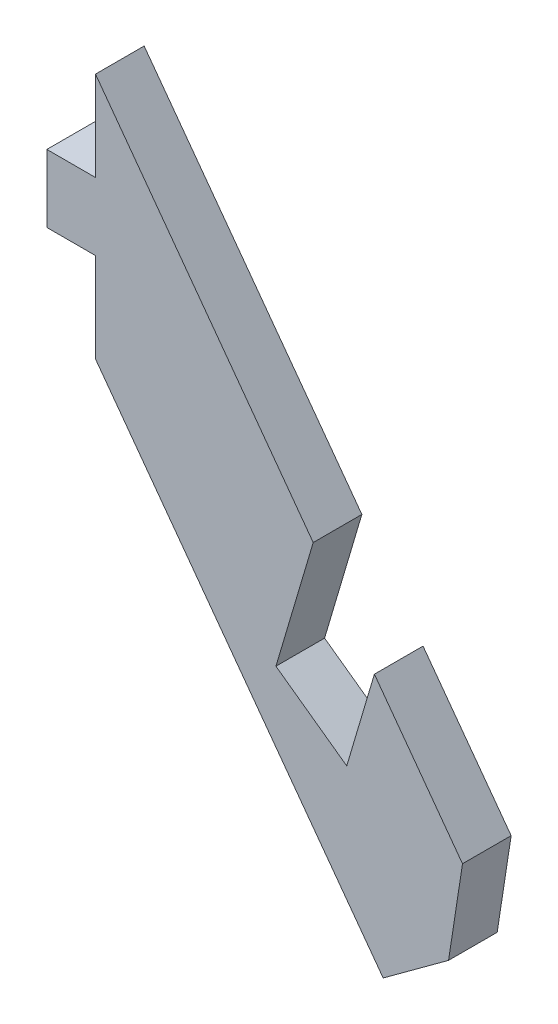
ISO-10303-21;
HEADER;
FILE_DESCRIPTION(('STEP AP214'),'2;1');
FILE_NAME('part.step','',(''),(''),'','','');
FILE_SCHEMA(('AUTOMOTIVE_DESIGN { 1 0 10303 214 1 1 1 1 }'));
ENDSEC;
DATA;
#1=APPLICATION_CONTEXT('core data for automotive mechanical design processes');
#2=APPLICATION_PROTOCOL_DEFINITION('international standard','automotive_design',2000,#1);
#3=PRODUCT_CONTEXT('',#1,'mechanical');
#4=PRODUCT('Part','Part','',(#3));
#5=PRODUCT_RELATED_PRODUCT_CATEGORY('part','',(#4));
#6=PRODUCT_DEFINITION_FORMATION('','',#4);
#7=PRODUCT_DEFINITION_CONTEXT('part definition',#1,'design');
#8=PRODUCT_DEFINITION('design','',#6,#7);
#9=PRODUCT_DEFINITION_SHAPE('','',#8);
#10=(LENGTH_UNIT() NAMED_UNIT(*) SI_UNIT(.MILLI.,.METRE.));
#11=(NAMED_UNIT(*) PLANE_ANGLE_UNIT() SI_UNIT($,.RADIAN.));
#12=(NAMED_UNIT(*) SI_UNIT($,.STERADIAN.) SOLID_ANGLE_UNIT());
#13=UNCERTAINTY_MEASURE_WITH_UNIT(LENGTH_MEASURE(1.E-05),#10,'distance_accuracy_value','');
#14=(GEOMETRIC_REPRESENTATION_CONTEXT(3) GLOBAL_UNCERTAINTY_ASSIGNED_CONTEXT((#13)) GLOBAL_UNIT_ASSIGNED_CONTEXT((#10,
#11,#12)) REPRESENTATION_CONTEXT('',''));
#15=CARTESIAN_POINT('',(0.,0.,0.));
#16=DIRECTION('',(0.,0.,1.));
#17=DIRECTION('',(1.,0.,0.));
#18=AXIS2_PLACEMENT_3D('',#15,#16,#17);
#19=CARTESIAN_POINT('',(0.,14.5,-3.));
#20=DIRECTION('',(0.806359702266459,0.591425422653396,0.));
#21=DIRECTION('',(-0.591425422653396,0.806359702266459,0.));
#22=AXIS2_PLACEMENT_3D('',#19,#20,#21);
#23=PLANE('',#22);
#24=DIRECTION('',(0.,0.,-1.));
#25=VECTOR('',#24,1.);
#26=CARTESIAN_POINT('',(13.4271237133215,-3.80677388062509,12.4751845407217));
#27=LINE('',#26,#25);
#28=CARTESIAN_POINT('',(13.4271237133215,-3.80677388062509,0.));
#29=VERTEX_POINT('',#28);
#30=CARTESIAN_POINT('',(13.4271237133215,-3.80677388062509,-3.));
#31=VERTEX_POINT('',#30);
#32=EDGE_CURVE('E136',#29,#31,#27,.T.);
#33=ORIENTED_EDGE('',*,*,#32,.T.);
#34=DIRECTION('',(-0.591425422653396,0.806359702266459,0.));
#35=VECTOR('',#34,1.);
#36=CARTESIAN_POINT('',(0.,14.5,-3.));
#37=LINE('',#36,#35);
#38=CARTESIAN_POINT('',(0.,14.5,-3.));
#39=VERTEX_POINT('',#38);
#40=EDGE_CURVE('E150',#31,#39,#37,.T.);
#41=ORIENTED_EDGE('',*,*,#40,.T.);
#42=DIRECTION('',(0.,0.,1.));
#43=VECTOR('',#42,1.);
#44=CARTESIAN_POINT('',(0.,14.5,-3.));
#45=LINE('',#44,#43);
#46=CARTESIAN_POINT('',(0.,14.5,0.));
#47=VERTEX_POINT('',#46);
#48=EDGE_CURVE('E185',#39,#47,#45,.T.);
#49=ORIENTED_EDGE('',*,*,#48,.T.);
#50=DIRECTION('',(-0.591425422653396,0.806359702266459,0.));
#51=VECTOR('',#50,1.);
#52=CARTESIAN_POINT('',(0.,14.5,0.));
#53=LINE('',#52,#51);
#54=EDGE_CURVE('E152',#29,#47,#53,.T.);
#55=ORIENTED_EDGE('',*,*,#54,.F.);
#56=EDGE_LOOP('',(#33,#41,#49,#55));
#57=FACE_BOUND('',#56,.T.);
#58=ADVANCED_FACE('F39',(#57),#23,.T.);
#59=CARTESIAN_POINT('',(0.,14.5,-3.));
#60=DIRECTION('',(-1.,0.,0.));
#61=DIRECTION('',(0.,-1.,0.));
#62=AXIS2_PLACEMENT_3D('',#59,#60,#61);
#63=PLANE('',#62);
#64=DIRECTION('',(0.,-1.,0.));
#65=VECTOR('',#64,1.);
#66=CARTESIAN_POINT('',(0.,14.5,-3.));
#67=LINE('',#66,#65);
#68=CARTESIAN_POINT('',(0.,8.97626383879308,-3.));
#69=VERTEX_POINT('',#68);
#70=EDGE_CURVE('E160',#39,#69,#67,.T.);
#71=ORIENTED_EDGE('',*,*,#70,.T.);
#72=DIRECTION('',(0.,0.,1.));
#73=VECTOR('',#72,1.);
#74=CARTESIAN_POINT('',(0.,8.97626383879308,-8.13701275061684));
#75=LINE('',#74,#73);
#76=CARTESIAN_POINT('',(0.,8.97626383879308,0.));
#77=VERTEX_POINT('',#76);
#78=EDGE_CURVE('E173',#69,#77,#75,.T.);
#79=ORIENTED_EDGE('',*,*,#78,.T.);
#80=DIRECTION('',(0.,-1.,0.));
#81=VECTOR('',#80,1.);
#82=CARTESIAN_POINT('',(0.,14.5,0.));
#83=LINE('',#82,#81);
#84=EDGE_CURVE('E190',#47,#77,#83,.T.);
#85=ORIENTED_EDGE('',*,*,#84,.F.);
#86=ORIENTED_EDGE('',*,*,#48,.F.);
#87=EDGE_LOOP('',(#71,#79,#85,#86));
#88=FACE_BOUND('',#87,.T.);
#89=ADVANCED_FACE('F252',(#88),#63,.T.);
#90=CARTESIAN_POINT('',(22.6342983093864,-16.3599957774612,0.));
#91=VERTEX_POINT('',#90);
#92=CARTESIAN_POINT('',(17.2005647618662,-8.95154900167658,0.));
#93=VERTEX_POINT('',#92);
#94=EDGE_CURVE('E186',#91,#93,#53,.T.);
#95=ORIENTED_EDGE('',*,*,#94,.F.);
#96=DIRECTION('',(0.,0.,-1.));
#97=VECTOR('',#96,1.);
#98=CARTESIAN_POINT('',(22.6342983093864,-16.3599957774612,-3.));
#99=LINE('',#98,#97);
#100=CARTESIAN_POINT('',(22.6342983093864,-16.3599957774612,-3.));
#101=VERTEX_POINT('',#100);
#102=EDGE_CURVE('E49',#91,#101,#99,.T.);
#103=ORIENTED_EDGE('',*,*,#102,.T.);
#104=CARTESIAN_POINT('',(17.2005647618662,-8.95154900167658,-3.));
#105=VERTEX_POINT('',#104);
#106=EDGE_CURVE('E162',#101,#105,#37,.T.);
#107=ORIENTED_EDGE('',*,*,#106,.T.);
#108=DIRECTION('',(0.,0.,-1.));
#109=VECTOR('',#108,1.);
#110=CARTESIAN_POINT('',(17.2005647618662,-8.95154900167658,12.4751845407217));
#111=LINE('',#110,#109);
#112=EDGE_CURVE('E154',#93,#105,#111,.T.);
#113=ORIENTED_EDGE('',*,*,#112,.F.);
#114=EDGE_LOOP('',(#95,#103,#107,#113));
#115=FACE_BOUND('',#114,.T.);
#116=ADVANCED_FACE('F253',(#115),#23,.T.);
#117=CARTESIAN_POINT('',(25.,-19.5854345865271,-3.));
#118=DIRECTION('',(0.591425422653395,-0.806359702266459,0.));
#119=DIRECTION('',(0.806359702266459,0.591425422653395,0.));
#120=AXIS2_PLACEMENT_3D('',#117,#118,#119);
#121=PLANE('',#120);
#122=DIRECTION('',(0.806359702266459,0.591425422653395,0.));
#123=VECTOR('',#122,1.);
#124=CARTESIAN_POINT('',(25.,-19.5854345865271,-3.));
#125=LINE('',#124,#123);
#126=CARTESIAN_POINT('',(17.7427626796019,-24.9082633904076,-3.));
#127=VERTEX_POINT('',#126);
#128=CARTESIAN_POINT('',(21.7745611909342,-21.9511362771407,-3.));
#129=VERTEX_POINT('',#128);
#130=EDGE_CURVE('E181',#127,#129,#125,.T.);
#131=ORIENTED_EDGE('',*,*,#130,.T.);
#132=DIRECTION('',(0.,0.,1.));
#133=VECTOR('',#132,1.);
#134=CARTESIAN_POINT('',(21.7745611909342,-21.9511362771407,-3.));
#135=LINE('',#134,#133);
#136=CARTESIAN_POINT('',(21.7745611909342,-21.9511362771407,0.));
#137=VERTEX_POINT('',#136);
#138=EDGE_CURVE('E200',#129,#137,#135,.T.);
#139=ORIENTED_EDGE('',*,*,#138,.T.);
#140=DIRECTION('',(0.806359702266459,0.591425422653395,0.));
#141=VECTOR('',#140,1.);
#142=CARTESIAN_POINT('',(25.,-19.5854345865271,0.));
#143=LINE('',#142,#141);
#144=CARTESIAN_POINT('',(17.7427626796019,-24.9082633904076,0.));
#145=VERTEX_POINT('',#144);
#146=EDGE_CURVE('E163',#145,#137,#143,.T.);
#147=ORIENTED_EDGE('',*,*,#146,.F.);
#148=DIRECTION('',(0.,0.,1.));
#149=VECTOR('',#148,1.);
#150=CARTESIAN_POINT('',(17.7427626796019,-24.9082633904076,-3.));
#151=LINE('',#150,#149);
#152=EDGE_CURVE('E197',#127,#145,#151,.T.);
#153=ORIENTED_EDGE('',*,*,#152,.F.);
#154=EDGE_LOOP('',(#131,#139,#147,#153));
#155=FACE_BOUND('',#154,.T.);
#156=ADVANCED_FACE('F240',(#155),#121,.T.);
#157=CARTESIAN_POINT('',(17.7427626796019,-24.9082633904076,-3.));
#158=DIRECTION('',(-0.806359702266459,-0.591425422653396,0.));
#159=DIRECTION('',(0.591425422653396,-0.806359702266459,0.));
#160=AXIS2_PLACEMENT_3D('',#157,#158,#159);
#161=PLANE('',#160);
#162=DIRECTION('',(0.591425422653396,-0.806359702266459,0.));
#163=VECTOR('',#162,1.);
#164=CARTESIAN_POINT('',(17.7427626796019,-24.9082633904076,0.));
#165=LINE('',#164,#163);
#166=CARTESIAN_POINT('',(0.,-0.717472322413876,0.));
#167=VERTEX_POINT('',#166);
#168=EDGE_CURVE('E169',#167,#145,#165,.T.);
#169=ORIENTED_EDGE('',*,*,#168,.F.);
#170=DIRECTION('',(0.,0.,1.));
#171=VECTOR('',#170,1.);
#172=CARTESIAN_POINT('',(0.,-0.717472322413876,-3.));
#173=LINE('',#172,#171);
#174=CARTESIAN_POINT('',(0.,-0.717472322413876,-3.));
#175=VERTEX_POINT('',#174);
#176=EDGE_CURVE('E201',#175,#167,#173,.T.);
#177=ORIENTED_EDGE('',*,*,#176,.F.);
#178=DIRECTION('',(0.591425422653396,-0.806359702266459,0.));
#179=VECTOR('',#178,1.);
#180=CARTESIAN_POINT('',(17.7427626796019,-24.9082633904076,-3.));
#181=LINE('',#180,#179);
#182=EDGE_CURVE('E177',#175,#127,#181,.T.);
#183=ORIENTED_EDGE('',*,*,#182,.T.);
#184=ORIENTED_EDGE('',*,*,#152,.T.);
#185=EDGE_LOOP('',(#169,#177,#183,#184));
#186=FACE_BOUND('',#185,.T.);
#187=ADVANCED_FACE('F235',(#186),#161,.T.);
#188=DIRECTION('',(0.,0.,1.));
#189=VECTOR('',#188,1.);
#190=CARTESIAN_POINT('',(0.,4.80626383879308,-8.13701275061684));
#191=LINE('',#190,#189);
#192=CARTESIAN_POINT('',(0.,4.80626383879308,-3.));
#193=VERTEX_POINT('',#192);
#194=CARTESIAN_POINT('',(0.,4.80626383879308,0.));
#195=VERTEX_POINT('',#194);
#196=EDGE_CURVE('E232',#193,#195,#191,.T.);
#197=ORIENTED_EDGE('',*,*,#196,.F.);
#198=EDGE_CURVE('E168',#193,#175,#67,.T.);
#199=ORIENTED_EDGE('',*,*,#198,.T.);
#200=ORIENTED_EDGE('',*,*,#176,.T.);
#201=EDGE_CURVE('E189',#195,#167,#83,.T.);
#202=ORIENTED_EDGE('',*,*,#201,.F.);
#203=EDGE_LOOP('',(#197,#199,#200,#202));
#204=FACE_BOUND('',#203,.T.);
#205=ADVANCED_FACE('F229',(#204),#63,.T.);
#206=CARTESIAN_POINT('',(0.,0.,-3.));
#207=DIRECTION('',(0.,0.,-1.));
#208=DIRECTION('',(-1.,0.,0.));
#209=AXIS2_PLACEMENT_3D('',#206,#207,#208);
#210=PLANE('',#209);
#211=ORIENTED_EDGE('',*,*,#106,.F.);
#212=DIRECTION('',(0.151981486623839,0.988383340472515,0.));
#213=VECTOR('',#212,1.);
#214=CARTESIAN_POINT('',(24.5690154865547,-3.77792233602964,-3.));
#215=LINE('',#214,#213);
#216=EDGE_CURVE('E11',#101,#129,#215,.F.);
#217=ORIENTED_EDGE('',*,*,#216,.T.);
#218=ORIENTED_EDGE('',*,*,#130,.F.);
#219=ORIENTED_EDGE('',*,*,#182,.F.);
#220=ORIENTED_EDGE('',*,*,#198,.F.);
#221=DIRECTION('',(1.,0.,0.));
#222=VECTOR('',#221,1.);
#223=CARTESIAN_POINT('',(-3.,4.80626383879308,-3.));
#224=LINE('',#223,#222);
#225=CARTESIAN_POINT('',(-3.,4.80626383879308,-3.));
#226=VERTEX_POINT('',#225);
#227=EDGE_CURVE('E312',#226,#193,#224,.T.);
#228=ORIENTED_EDGE('',*,*,#227,.F.);
#229=DIRECTION('',(0.,-1.,0.));
#230=VECTOR('',#229,1.);
#231=CARTESIAN_POINT('',(-3.,8.97626383879308,-3.));
#232=LINE('',#231,#230);
#233=CARTESIAN_POINT('',(-3.,8.97626383879308,-3.));
#234=VERTEX_POINT('',#233);
#235=EDGE_CURVE('E316',#234,#226,#232,.T.);
#236=ORIENTED_EDGE('',*,*,#235,.F.);
#237=DIRECTION('',(-1.,0.,0.));
#238=VECTOR('',#237,1.);
#239=CARTESIAN_POINT('',(0.,8.97626383879308,-3.));
#240=LINE('',#239,#238);
#241=EDGE_CURVE('E300',#69,#234,#240,.T.);
#242=ORIENTED_EDGE('',*,*,#241,.F.);
#243=ORIENTED_EDGE('',*,*,#70,.F.);
#244=ORIENTED_EDGE('',*,*,#40,.F.);
#245=DIRECTION('',(0.284202889860851,0.958764161509358,0.));
#246=VECTOR('',#245,1.);
#247=CARTESIAN_POINT('',(11.1278575903001,-11.5633943625804,-3.));
#248=LINE('',#247,#246);
#249=CARTESIAN_POINT('',(11.1278575903001,-11.5633943625804,-3.));
#250=VERTEX_POINT('',#249);
#251=EDGE_CURVE('E133',#250,#31,#248,.T.);
#252=ORIENTED_EDGE('',*,*,#251,.F.);
#253=DIRECTION('',(-0.8118738374324,0.583832914533592,0.));
#254=VECTOR('',#253,1.);
#255=CARTESIAN_POINT('',(15.4953474227011,-14.7041339707327,-3.));
#256=LINE('',#255,#254);
#257=CARTESIAN_POINT('',(15.4953474227011,-14.7041339707327,-3.));
#258=VERTEX_POINT('',#257);
#259=EDGE_CURVE('E155',#258,#250,#256,.T.);
#260=ORIENTED_EDGE('',*,*,#259,.F.);
#261=DIRECTION('',(-0.28420288986085,-0.958764161509358,0.));
#262=VECTOR('',#261,1.);
#263=CARTESIAN_POINT('',(17.2005647618662,-8.95154900167658,-3.));
#264=LINE('',#263,#262);
#265=EDGE_CURVE('E145',#105,#258,#264,.T.);
#266=ORIENTED_EDGE('',*,*,#265,.F.);
#267=EDGE_LOOP('',(#211,#217,#218,#219,#220,#228,#236,#242,#243,#244,#252,#260,#266));
#268=FACE_BOUND('',#267,.T.);
#269=ADVANCED_FACE('F158',(#268),#210,.T.);
#270=CARTESIAN_POINT('',(0.,0.,0.));
#271=DIRECTION('',(0.,0.,-1.));
#272=DIRECTION('',(-1.,0.,0.));
#273=AXIS2_PLACEMENT_3D('',#270,#271,#272);
#274=PLANE('',#273);
#275=ORIENTED_EDGE('',*,*,#146,.T.);
#276=DIRECTION('',(-0.151981486623839,-0.988383340472515,0.));
#277=VECTOR('',#276,1.);
#278=CARTESIAN_POINT('',(21.7745611909342,-21.9511362771407,0.));
#279=LINE('',#278,#277);
#280=EDGE_CURVE('E63',#137,#91,#279,.F.);
#281=ORIENTED_EDGE('',*,*,#280,.T.);
#282=ORIENTED_EDGE('',*,*,#94,.T.);
#283=DIRECTION('',(0.28420288986085,0.958764161509358,0.));
#284=VECTOR('',#283,1.);
#285=CARTESIAN_POINT('',(17.2005647618662,-8.95154900167658,0.));
#286=LINE('',#285,#284);
#287=CARTESIAN_POINT('',(15.4953474227011,-14.7041339707327,0.));
#288=VERTEX_POINT('',#287);
#289=EDGE_CURVE('E270',#288,#93,#286,.T.);
#290=ORIENTED_EDGE('',*,*,#289,.F.);
#291=DIRECTION('',(0.8118738374324,-0.583832914533592,0.));
#292=VECTOR('',#291,1.);
#293=CARTESIAN_POINT('',(15.4953474227011,-14.7041339707327,0.));
#294=LINE('',#293,#292);
#295=CARTESIAN_POINT('',(11.1278575903001,-11.5633943625804,0.));
#296=VERTEX_POINT('',#295);
#297=EDGE_CURVE('E276',#296,#288,#294,.T.);
#298=ORIENTED_EDGE('',*,*,#297,.F.);
#299=DIRECTION('',(-0.284202889860851,-0.958764161509358,0.));
#300=VECTOR('',#299,1.);
#301=CARTESIAN_POINT('',(11.1278575903001,-11.5633943625804,0.));
#302=LINE('',#301,#300);
#303=EDGE_CURVE('E281',#29,#296,#302,.T.);
#304=ORIENTED_EDGE('',*,*,#303,.F.);
#305=ORIENTED_EDGE('',*,*,#54,.T.);
#306=ORIENTED_EDGE('',*,*,#84,.T.);
#307=DIRECTION('',(-1.,0.,0.));
#308=VECTOR('',#307,1.);
#309=CARTESIAN_POINT('',(0.,8.97626383879308,0.));
#310=LINE('',#309,#308);
#311=CARTESIAN_POINT('',(-3.,8.97626383879308,0.));
#312=VERTEX_POINT('',#311);
#313=EDGE_CURVE('E286',#77,#312,#310,.T.);
#314=ORIENTED_EDGE('',*,*,#313,.T.);
#315=DIRECTION('',(0.,-1.,0.));
#316=VECTOR('',#315,1.);
#317=CARTESIAN_POINT('',(-3.,8.97626383879308,0.));
#318=LINE('',#317,#316);
#319=CARTESIAN_POINT('',(-3.,4.80626383879308,0.));
#320=VERTEX_POINT('',#319);
#321=EDGE_CURVE('E301',#312,#320,#318,.T.);
#322=ORIENTED_EDGE('',*,*,#321,.T.);
#323=DIRECTION('',(1.,0.,0.));
#324=VECTOR('',#323,1.);
#325=CARTESIAN_POINT('',(-3.,4.80626383879308,0.));
#326=LINE('',#325,#324);
#327=EDGE_CURVE('E296',#320,#195,#326,.T.);
#328=ORIENTED_EDGE('',*,*,#327,.T.);
#329=ORIENTED_EDGE('',*,*,#201,.T.);
#330=ORIENTED_EDGE('',*,*,#168,.T.);
#331=EDGE_LOOP('',(#275,#281,#282,#290,#298,#304,#305,#306,#314,#322,#328,#329,#330));
#332=FACE_BOUND('',#331,.T.);
#333=ADVANCED_FACE('F268',(#332),#274,.F.);
#334=CARTESIAN_POINT('',(0.,8.97626383879308,-8.13701275061684));
#335=DIRECTION('',(0.,1.,0.));
#336=DIRECTION('',(0.,0.,1.));
#337=AXIS2_PLACEMENT_3D('',#334,#335,#336);
#338=PLANE('',#337);
#339=ORIENTED_EDGE('',*,*,#78,.F.);
#340=ORIENTED_EDGE('',*,*,#241,.T.);
#341=DIRECTION('',(0.,0.,1.));
#342=VECTOR('',#341,1.);
#343=CARTESIAN_POINT('',(-3.,8.97626383879308,-8.13701275061684));
#344=LINE('',#343,#342);
#345=EDGE_CURVE('E311',#234,#312,#344,.T.);
#346=ORIENTED_EDGE('',*,*,#345,.T.);
#347=ORIENTED_EDGE('',*,*,#313,.F.);
#348=EDGE_LOOP('',(#339,#340,#346,#347));
#349=FACE_BOUND('',#348,.T.);
#350=ADVANCED_FACE('F329',(#349),#338,.T.);
#351=CARTESIAN_POINT('',(-3.,8.97626383879308,-8.13701275061684));
#352=DIRECTION('',(-1.,0.,0.));
#353=DIRECTION('',(0.,-1.,0.));
#354=AXIS2_PLACEMENT_3D('',#351,#352,#353);
#355=PLANE('',#354);
#356=ORIENTED_EDGE('',*,*,#345,.F.);
#357=ORIENTED_EDGE('',*,*,#235,.T.);
#358=DIRECTION('',(0.,0.,1.));
#359=VECTOR('',#358,1.);
#360=CARTESIAN_POINT('',(-3.,4.80626383879308,-8.13701275061684));
#361=LINE('',#360,#359);
#362=EDGE_CURVE('E315',#226,#320,#361,.T.);
#363=ORIENTED_EDGE('',*,*,#362,.T.);
#364=ORIENTED_EDGE('',*,*,#321,.F.);
#365=EDGE_LOOP('',(#356,#357,#363,#364));
#366=FACE_BOUND('',#365,.T.);
#367=ADVANCED_FACE('F332',(#366),#355,.T.);
#368=CARTESIAN_POINT('',(-3.,4.80626383879308,-8.13701275061684));
#369=DIRECTION('',(0.,-1.,0.));
#370=DIRECTION('',(0.,0.,-1.));
#371=AXIS2_PLACEMENT_3D('',#368,#369,#370);
#372=PLANE('',#371);
#373=ORIENTED_EDGE('',*,*,#362,.F.);
#374=ORIENTED_EDGE('',*,*,#227,.T.);
#375=ORIENTED_EDGE('',*,*,#196,.T.);
#376=ORIENTED_EDGE('',*,*,#327,.F.);
#377=EDGE_LOOP('',(#373,#374,#375,#376));
#378=FACE_BOUND('',#377,.T.);
#379=ADVANCED_FACE('F347',(#378),#372,.T.);
#380=CARTESIAN_POINT('',(11.1278575903001,-11.5633943625804,12.4751845407217));
#381=DIRECTION('',(-0.958764161509357,0.284202889860851,0.));
#382=DIRECTION('',(-0.284202889860851,-0.958764161509358,0.));
#383=AXIS2_PLACEMENT_3D('',#380,#381,#382);
#384=PLANE('',#383);
#385=ORIENTED_EDGE('',*,*,#303,.T.);
#386=DIRECTION('',(0.,0.,-1.));
#387=VECTOR('',#386,1.);
#388=CARTESIAN_POINT('',(11.1278575903001,-11.5633943625804,12.4751845407217));
#389=LINE('',#388,#387);
#390=EDGE_CURVE('E139',#296,#250,#389,.T.);
#391=ORIENTED_EDGE('',*,*,#390,.T.);
#392=ORIENTED_EDGE('',*,*,#251,.T.);
#393=ORIENTED_EDGE('',*,*,#32,.F.);
#394=EDGE_LOOP('',(#385,#391,#392,#393));
#395=FACE_BOUND('',#394,.T.);
#396=ADVANCED_FACE('F135',(#395),#384,.F.);
#397=CARTESIAN_POINT('',(15.4953474227011,-14.7041339707327,12.4751845407217));
#398=DIRECTION('',(-0.583832914533592,-0.8118738374324,0.));
#399=DIRECTION('',(0.8118738374324,-0.583832914533592,0.));
#400=AXIS2_PLACEMENT_3D('',#397,#398,#399);
#401=PLANE('',#400);
#402=ORIENTED_EDGE('',*,*,#297,.T.);
#403=DIRECTION('',(0.,0.,-1.));
#404=VECTOR('',#403,1.);
#405=CARTESIAN_POINT('',(15.4953474227011,-14.7041339707327,12.4751845407217));
#406=LINE('',#405,#404);
#407=EDGE_CURVE('E273',#288,#258,#406,.T.);
#408=ORIENTED_EDGE('',*,*,#407,.T.);
#409=ORIENTED_EDGE('',*,*,#259,.T.);
#410=ORIENTED_EDGE('',*,*,#390,.F.);
#411=EDGE_LOOP('',(#402,#408,#409,#410));
#412=FACE_BOUND('',#411,.T.);
#413=ADVANCED_FACE('F248',(#412),#401,.F.);
#414=CARTESIAN_POINT('',(17.2005647618662,-8.95154900167658,12.4751845407217));
#415=DIRECTION('',(0.958764161509357,-0.28420288986085,0.));
#416=DIRECTION('',(0.28420288986085,0.958764161509358,0.));
#417=AXIS2_PLACEMENT_3D('',#414,#415,#416);
#418=PLANE('',#417);
#419=ORIENTED_EDGE('',*,*,#289,.T.);
#420=ORIENTED_EDGE('',*,*,#112,.T.);
#421=ORIENTED_EDGE('',*,*,#265,.T.);
#422=ORIENTED_EDGE('',*,*,#407,.F.);
#423=EDGE_LOOP('',(#419,#420,#421,#422));
#424=FACE_BOUND('',#423,.T.);
#425=ADVANCED_FACE('F244',(#424),#418,.F.);
#426=CARTESIAN_POINT('',(21.7745611909342,-21.9511362771407,-3.));
#427=DIRECTION('',(-0.988383340472515,0.151981486623839,0.));
#428=DIRECTION('',(0.,0.,1.));
#429=AXIS2_PLACEMENT_3D('',#426,#427,#428);
#430=PLANE('',#429);
#431=ORIENTED_EDGE('',*,*,#216,.F.);
#432=ORIENTED_EDGE('',*,*,#102,.F.);
#433=ORIENTED_EDGE('',*,*,#280,.F.);
#434=ORIENTED_EDGE('',*,*,#138,.F.);
#435=EDGE_LOOP('',(#431,#432,#433,#434));
#436=FACE_BOUND('',#435,.T.);
#437=ADVANCED_FACE('F42',(#436),#430,.F.);
#438=CLOSED_SHELL('',(#58,#89,#116,#156,#187,#205,#269,#333,#350,#367,#379,#396,#413,#425,#437));
#439=MANIFOLD_SOLID_BREP('B2',#438);
#440=ADVANCED_BREP_SHAPE_REPRESENTATION('',(#18,#439),#14);
#441=SHAPE_DEFINITION_REPRESENTATION(#9,#440);
ENDSEC;
END-ISO-10303-21;
